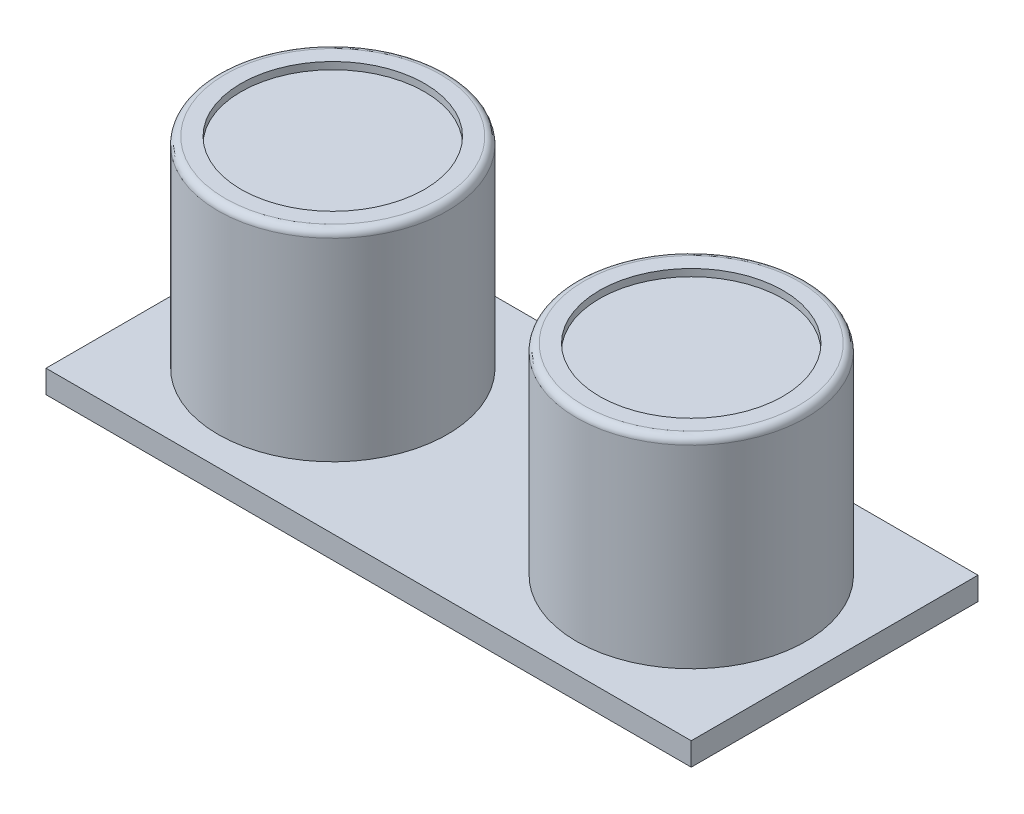
ISO-10303-21;
HEADER;
FILE_DESCRIPTION(('STEP AP214'),'2;1');
FILE_NAME('part.step','',(''),(''),'','','');
FILE_SCHEMA(('AUTOMOTIVE_DESIGN { 1 0 10303 214 1 1 1 1 }'));
ENDSEC;
DATA;
#1=APPLICATION_CONTEXT('core data for automotive mechanical design processes');
#2=APPLICATION_PROTOCOL_DEFINITION('international standard','automotive_design',2000,#1);
#3=PRODUCT_CONTEXT('',#1,'mechanical');
#4=PRODUCT('Part','Part','',(#3));
#5=PRODUCT_RELATED_PRODUCT_CATEGORY('part','',(#4));
#6=PRODUCT_DEFINITION_FORMATION('','',#4);
#7=PRODUCT_DEFINITION_CONTEXT('part definition',#1,'design');
#8=PRODUCT_DEFINITION('design','',#6,#7);
#9=PRODUCT_DEFINITION_SHAPE('','',#8);
#10=(LENGTH_UNIT() NAMED_UNIT(*) SI_UNIT(.MILLI.,.METRE.));
#11=(NAMED_UNIT(*) PLANE_ANGLE_UNIT() SI_UNIT($,.RADIAN.));
#12=(NAMED_UNIT(*) SI_UNIT($,.STERADIAN.) SOLID_ANGLE_UNIT());
#13=UNCERTAINTY_MEASURE_WITH_UNIT(LENGTH_MEASURE(1.E-05),#10,'distance_accuracy_value','');
#14=(GEOMETRIC_REPRESENTATION_CONTEXT(3) GLOBAL_UNCERTAINTY_ASSIGNED_CONTEXT((#13)) GLOBAL_UNIT_ASSIGNED_CONTEXT((#10,
#11,#12)) REPRESENTATION_CONTEXT('',''));
#15=CARTESIAN_POINT('',(0.,0.,0.));
#16=DIRECTION('',(0.,0.,1.));
#17=DIRECTION('',(1.,0.,0.));
#18=AXIS2_PLACEMENT_3D('',#15,#16,#17);
#19=CARTESIAN_POINT('',(0.,1.6,0.));
#20=DIRECTION('',(1.,0.,0.));
#21=DIRECTION('',(0.,0.,-1.));
#22=AXIS2_PLACEMENT_3D('',#19,#20,#21);
#23=PLANE('',#22);
#24=DIRECTION('',(0.,0.,1.));
#25=VECTOR('',#24,1.);
#26=CARTESIAN_POINT('',(0.,0.,0.));
#27=LINE('',#26,#25);
#28=CARTESIAN_POINT('',(0.,0.,-20.));
#29=VERTEX_POINT('',#28);
#30=CARTESIAN_POINT('',(0.,0.,0.));
#31=VERTEX_POINT('',#30);
#32=EDGE_CURVE('E104',#29,#31,#27,.T.);
#33=ORIENTED_EDGE('',*,*,#32,.T.);
#34=DIRECTION('',(0.,-1.,0.));
#35=VECTOR('',#34,1.);
#36=CARTESIAN_POINT('',(0.,1.6,0.));
#37=LINE('',#36,#35);
#38=CARTESIAN_POINT('',(0.,1.6,0.));
#39=VERTEX_POINT('',#38);
#40=EDGE_CURVE('E95',#39,#31,#37,.T.);
#41=ORIENTED_EDGE('',*,*,#40,.F.);
#42=DIRECTION('',(0.,0.,1.));
#43=VECTOR('',#42,1.);
#44=CARTESIAN_POINT('',(0.,1.6,0.));
#45=LINE('',#44,#43);
#46=CARTESIAN_POINT('',(0.,1.6,-20.));
#47=VERTEX_POINT('',#46);
#48=EDGE_CURVE('E89',#47,#39,#45,.T.);
#49=ORIENTED_EDGE('',*,*,#48,.F.);
#50=DIRECTION('',(0.,-1.,0.));
#51=VECTOR('',#50,1.);
#52=CARTESIAN_POINT('',(0.,1.6,-20.));
#53=LINE('',#52,#51);
#54=EDGE_CURVE('E100',#47,#29,#53,.T.);
#55=ORIENTED_EDGE('',*,*,#54,.T.);
#56=EDGE_LOOP('',(#33,#41,#49,#55));
#57=FACE_BOUND('',#56,.T.);
#58=ADVANCED_FACE('F36',(#57),#23,.F.);
#59=CARTESIAN_POINT('',(0.,1.6,0.));
#60=DIRECTION('',(0.,0.,-1.));
#61=DIRECTION('',(-1.,0.,0.));
#62=AXIS2_PLACEMENT_3D('',#59,#60,#61);
#63=PLANE('',#62);
#64=DIRECTION('',(1.,0.,0.));
#65=VECTOR('',#64,1.);
#66=CARTESIAN_POINT('',(0.,0.,0.));
#67=LINE('',#66,#65);
#68=CARTESIAN_POINT('',(45.,0.,0.));
#69=VERTEX_POINT('',#68);
#70=EDGE_CURVE('E94',#31,#69,#67,.T.);
#71=ORIENTED_EDGE('',*,*,#70,.T.);
#72=DIRECTION('',(0.,-1.,0.));
#73=VECTOR('',#72,1.);
#74=CARTESIAN_POINT('',(45.,1.6,0.));
#75=LINE('',#74,#73);
#76=CARTESIAN_POINT('',(45.,1.6,0.));
#77=VERTEX_POINT('',#76);
#78=EDGE_CURVE('E92',#77,#69,#75,.T.);
#79=ORIENTED_EDGE('',*,*,#78,.F.);
#80=DIRECTION('',(1.,0.,0.));
#81=VECTOR('',#80,1.);
#82=CARTESIAN_POINT('',(0.,1.6,0.));
#83=LINE('',#82,#81);
#84=EDGE_CURVE('E84',#39,#77,#83,.T.);
#85=ORIENTED_EDGE('',*,*,#84,.F.);
#86=ORIENTED_EDGE('',*,*,#40,.T.);
#87=EDGE_LOOP('',(#71,#79,#85,#86));
#88=FACE_BOUND('',#87,.T.);
#89=ADVANCED_FACE('F93',(#88),#63,.F.);
#90=CARTESIAN_POINT('',(45.,1.6,0.));
#91=DIRECTION('',(-1.,0.,0.));
#92=DIRECTION('',(0.,0.,1.));
#93=AXIS2_PLACEMENT_3D('',#90,#91,#92);
#94=PLANE('',#93);
#95=DIRECTION('',(0.,0.,-1.));
#96=VECTOR('',#95,1.);
#97=CARTESIAN_POINT('',(45.,0.,0.));
#98=LINE('',#97,#96);
#99=CARTESIAN_POINT('',(45.,0.,-20.));
#100=VERTEX_POINT('',#99);
#101=EDGE_CURVE('E70',#69,#100,#98,.T.);
#102=ORIENTED_EDGE('',*,*,#101,.T.);
#103=DIRECTION('',(0.,-1.,0.));
#104=VECTOR('',#103,1.);
#105=CARTESIAN_POINT('',(45.,1.6,-20.));
#106=LINE('',#105,#104);
#107=CARTESIAN_POINT('',(45.,1.6,-20.));
#108=VERTEX_POINT('',#107);
#109=EDGE_CURVE('E96',#108,#100,#106,.T.);
#110=ORIENTED_EDGE('',*,*,#109,.F.);
#111=DIRECTION('',(0.,0.,-1.));
#112=VECTOR('',#111,1.);
#113=CARTESIAN_POINT('',(45.,1.6,0.));
#114=LINE('',#113,#112);
#115=EDGE_CURVE('E87',#77,#108,#114,.T.);
#116=ORIENTED_EDGE('',*,*,#115,.F.);
#117=ORIENTED_EDGE('',*,*,#78,.T.);
#118=EDGE_LOOP('',(#102,#110,#116,#117));
#119=FACE_BOUND('',#118,.T.);
#120=ADVANCED_FACE('F98',(#119),#94,.F.);
#121=CARTESIAN_POINT('',(0.,1.6,-20.));
#122=DIRECTION('',(0.,0.,1.));
#123=DIRECTION('',(1.,0.,0.));
#124=AXIS2_PLACEMENT_3D('',#121,#122,#123);
#125=PLANE('',#124);
#126=DIRECTION('',(-1.,0.,0.));
#127=VECTOR('',#126,1.);
#128=CARTESIAN_POINT('',(0.,0.,-20.));
#129=LINE('',#128,#127);
#130=EDGE_CURVE('E76',#100,#29,#129,.T.);
#131=ORIENTED_EDGE('',*,*,#130,.T.);
#132=ORIENTED_EDGE('',*,*,#54,.F.);
#133=DIRECTION('',(-1.,0.,0.));
#134=VECTOR('',#133,1.);
#135=CARTESIAN_POINT('',(0.,1.6,-20.));
#136=LINE('',#135,#134);
#137=EDGE_CURVE('E53',#108,#47,#136,.T.);
#138=ORIENTED_EDGE('',*,*,#137,.F.);
#139=ORIENTED_EDGE('',*,*,#109,.T.);
#140=EDGE_LOOP('',(#131,#132,#138,#139));
#141=FACE_BOUND('',#140,.T.);
#142=ADVANCED_FACE('F150',(#141),#125,.F.);
#143=CARTESIAN_POINT('',(0.,1.6,0.));
#144=DIRECTION('',(0.,-1.,0.));
#145=DIRECTION('',(0.,0.,-1.));
#146=AXIS2_PLACEMENT_3D('',#143,#144,#145);
#147=PLANE('',#146);
#148=CARTESIAN_POINT('',(35.,1.6,-10.));
#149=DIRECTION('',(0.,-1.,0.));
#150=DIRECTION('',(0.,0.,-1.));
#151=AXIS2_PLACEMENT_3D('',#148,#149,#150);
#152=CIRCLE('',#151,8.);
#153=CARTESIAN_POINT('',(35.,1.6,-18.));
#154=VERTEX_POINT('',#153);
#155=EDGE_CURVE('E117',#154,#154,#152,.F.);
#156=ORIENTED_EDGE('',*,*,#155,.F.);
#157=EDGE_LOOP('',(#156));
#158=FACE_BOUND('',#157,.T.);
#159=CARTESIAN_POINT('',(10.,1.6,-10.));
#160=DIRECTION('',(0.,-1.,0.));
#161=DIRECTION('',(0.,0.,-1.));
#162=AXIS2_PLACEMENT_3D('',#159,#160,#161);
#163=CIRCLE('',#162,8.);
#164=CARTESIAN_POINT('',(10.,1.6,-18.));
#165=VERTEX_POINT('',#164);
#166=EDGE_CURVE('E114',#165,#165,#163,.F.);
#167=ORIENTED_EDGE('',*,*,#166,.F.);
#168=EDGE_LOOP('',(#167));
#169=FACE_BOUND('',#168,.T.);
#170=ORIENTED_EDGE('',*,*,#48,.T.);
#171=ORIENTED_EDGE('',*,*,#84,.T.);
#172=ORIENTED_EDGE('',*,*,#115,.T.);
#173=ORIENTED_EDGE('',*,*,#137,.T.);
#174=EDGE_LOOP('',(#170,#171,#172,#173));
#175=FACE_BOUND('',#174,.T.);
#176=ADVANCED_FACE('F85',(#158,#169,#175),#147,.F.);
#177=CARTESIAN_POINT('',(0.,0.,0.));
#178=DIRECTION('',(0.,-1.,0.));
#179=DIRECTION('',(0.,0.,-1.));
#180=AXIS2_PLACEMENT_3D('',#177,#178,#179);
#181=PLANE('',#180);
#182=ORIENTED_EDGE('',*,*,#32,.F.);
#183=ORIENTED_EDGE('',*,*,#130,.F.);
#184=ORIENTED_EDGE('',*,*,#101,.F.);
#185=ORIENTED_EDGE('',*,*,#70,.F.);
#186=EDGE_LOOP('',(#182,#183,#184,#185));
#187=FACE_BOUND('',#186,.T.);
#188=ADVANCED_FACE('F153',(#187),#181,.T.);
#189=CARTESIAN_POINT('',(10.,15.6,-10.));
#190=DIRECTION('',(0.,-1.,0.));
#191=DIRECTION('',(0.,0.,-1.));
#192=AXIS2_PLACEMENT_3D('',#189,#190,#191);
#193=CYLINDRICAL_SURFACE('',#192,8.);
#194=CARTESIAN_POINT('',(10.,15.1,-10.));
#195=DIRECTION('',(0.,1.,0.));
#196=DIRECTION('',(0.,0.,1.));
#197=AXIS2_PLACEMENT_3D('',#194,#195,#196);
#198=CIRCLE('',#197,8.);
#199=CARTESIAN_POINT('',(10.,15.1,-2.));
#200=VERTEX_POINT('',#199);
#201=EDGE_CURVE('E11',#200,#200,#198,.F.);
#202=ORIENTED_EDGE('',*,*,#201,.T.);
#203=EDGE_LOOP('',(#202));
#204=FACE_BOUND('',#203,.T.);
#205=ORIENTED_EDGE('',*,*,#166,.T.);
#206=EDGE_LOOP('',(#205));
#207=FACE_BOUND('',#206,.T.);
#208=ADVANCED_FACE('F156',(#204,#207),#193,.T.);
#209=CARTESIAN_POINT('',(10.,15.6,-10.));
#210=DIRECTION('',(0.,1.,0.));
#211=DIRECTION('',(0.,0.,1.));
#212=AXIS2_PLACEMENT_3D('',#209,#210,#211);
#213=PLANE('',#212);
#214=CARTESIAN_POINT('',(10.,15.6,-10.));
#215=DIRECTION('',(0.,1.,0.));
#216=DIRECTION('',(0.,0.,1.));
#217=AXIS2_PLACEMENT_3D('',#214,#215,#216);
#218=CIRCLE('',#217,7.5);
#219=CARTESIAN_POINT('',(10.,15.6,-2.5));
#220=VERTEX_POINT('',#219);
#221=EDGE_CURVE('E45',#220,#220,#218,.T.);
#222=ORIENTED_EDGE('',*,*,#221,.T.);
#223=EDGE_LOOP('',(#222));
#224=FACE_BOUND('',#223,.T.);
#225=CARTESIAN_POINT('',(10.,15.6,-10.));
#226=DIRECTION('',(0.,1.,0.));
#227=DIRECTION('',(0.,0.,1.));
#228=AXIS2_PLACEMENT_3D('',#225,#226,#227);
#229=CIRCLE('',#228,6.4);
#230=CARTESIAN_POINT('',(10.,15.6,-3.6));
#231=VERTEX_POINT('',#230);
#232=EDGE_CURVE('E192',#231,#231,#229,.T.);
#233=ORIENTED_EDGE('',*,*,#232,.F.);
#234=EDGE_LOOP('',(#233));
#235=FACE_BOUND('',#234,.T.);
#236=ADVANCED_FACE('F128',(#224,#235),#213,.T.);
#237=CARTESIAN_POINT('',(35.,15.6,-10.));
#238=DIRECTION('',(0.,-1.,0.));
#239=DIRECTION('',(0.,0.,-1.));
#240=AXIS2_PLACEMENT_3D('',#237,#238,#239);
#241=CYLINDRICAL_SURFACE('',#240,8.);
#242=CARTESIAN_POINT('',(35.,15.1,-10.));
#243=DIRECTION('',(0.,1.,0.));
#244=DIRECTION('',(0.,0.,1.));
#245=AXIS2_PLACEMENT_3D('',#242,#243,#244);
#246=CIRCLE('',#245,8.);
#247=CARTESIAN_POINT('',(35.,15.1,-2.));
#248=VERTEX_POINT('',#247);
#249=EDGE_CURVE('E123',#248,#248,#246,.F.);
#250=ORIENTED_EDGE('',*,*,#249,.T.);
#251=EDGE_LOOP('',(#250));
#252=FACE_BOUND('',#251,.T.);
#253=ORIENTED_EDGE('',*,*,#155,.T.);
#254=EDGE_LOOP('',(#253));
#255=FACE_BOUND('',#254,.T.);
#256=ADVANCED_FACE('F166',(#252,#255),#241,.T.);
#257=CARTESIAN_POINT('',(35.,15.6,-10.));
#258=DIRECTION('',(0.,1.,0.));
#259=DIRECTION('',(0.,0.,1.));
#260=AXIS2_PLACEMENT_3D('',#257,#258,#259);
#261=PLANE('',#260);
#262=CARTESIAN_POINT('',(35.,15.6,-10.));
#263=DIRECTION('',(0.,1.,0.));
#264=DIRECTION('',(0.,0.,1.));
#265=AXIS2_PLACEMENT_3D('',#262,#263,#264);
#266=CIRCLE('',#265,7.5);
#267=CARTESIAN_POINT('',(35.,15.6,-2.5));
#268=VERTEX_POINT('',#267);
#269=EDGE_CURVE('E120',#268,#268,#266,.T.);
#270=ORIENTED_EDGE('',*,*,#269,.T.);
#271=EDGE_LOOP('',(#270));
#272=FACE_BOUND('',#271,.T.);
#273=CARTESIAN_POINT('',(35.,15.6,-10.));
#274=DIRECTION('',(0.,1.,0.));
#275=DIRECTION('',(0.,0.,1.));
#276=AXIS2_PLACEMENT_3D('',#273,#274,#275);
#277=CIRCLE('',#276,6.39999999999999);
#278=CARTESIAN_POINT('',(35.,15.6,-3.60000000000001));
#279=VERTEX_POINT('',#278);
#280=EDGE_CURVE('E200',#279,#279,#277,.T.);
#281=ORIENTED_EDGE('',*,*,#280,.F.);
#282=EDGE_LOOP('',(#281));
#283=FACE_BOUND('',#282,.T.);
#284=ADVANCED_FACE('F169',(#272,#283),#261,.T.);
#285=CARTESIAN_POINT('',(35.,15.1,-10.));
#286=DIRECTION('',(0.,1.,0.));
#287=DIRECTION('',(0.,0.,1.));
#288=AXIS2_PLACEMENT_3D('',#285,#286,#287);
#289=CYLINDRICAL_SURFACE('',#288,6.39999999999999);
#290=CARTESIAN_POINT('',(35.,15.1,-10.));
#291=DIRECTION('',(0.,1.,0.));
#292=DIRECTION('',(0.,0.,1.));
#293=AXIS2_PLACEMENT_3D('',#290,#291,#292);
#294=CIRCLE('',#293,6.39999999999999);
#295=CARTESIAN_POINT('',(35.,15.1,-3.60000000000001));
#296=VERTEX_POINT('',#295);
#297=EDGE_CURVE('E195',#296,#296,#294,.T.);
#298=ORIENTED_EDGE('',*,*,#297,.F.);
#299=EDGE_LOOP('',(#298));
#300=FACE_BOUND('',#299,.T.);
#301=ORIENTED_EDGE('',*,*,#280,.T.);
#302=EDGE_LOOP('',(#301));
#303=FACE_BOUND('',#302,.T.);
#304=ADVANCED_FACE('F173',(#300,#303),#289,.F.);
#305=CARTESIAN_POINT('',(35.,15.1,-10.));
#306=DIRECTION('',(0.,1.,0.));
#307=DIRECTION('',(0.,0.,1.));
#308=AXIS2_PLACEMENT_3D('',#305,#306,#307);
#309=PLANE('',#308);
#310=ORIENTED_EDGE('',*,*,#297,.T.);
#311=EDGE_LOOP('',(#310));
#312=FACE_BOUND('',#311,.T.);
#313=ADVANCED_FACE('F177',(#312),#309,.T.);
#314=CARTESIAN_POINT('',(10.,15.1,-10.));
#315=DIRECTION('',(0.,1.,0.));
#316=DIRECTION('',(0.,0.,1.));
#317=AXIS2_PLACEMENT_3D('',#314,#315,#316);
#318=CYLINDRICAL_SURFACE('',#317,6.4);
#319=CARTESIAN_POINT('',(10.,15.1,-10.));
#320=DIRECTION('',(0.,1.,0.));
#321=DIRECTION('',(0.,0.,1.));
#322=AXIS2_PLACEMENT_3D('',#319,#320,#321);
#323=CIRCLE('',#322,6.4);
#324=CARTESIAN_POINT('',(10.,15.1,-3.6));
#325=VERTEX_POINT('',#324);
#326=EDGE_CURVE('E107',#325,#325,#323,.T.);
#327=ORIENTED_EDGE('',*,*,#326,.F.);
#328=EDGE_LOOP('',(#327));
#329=FACE_BOUND('',#328,.T.);
#330=ORIENTED_EDGE('',*,*,#232,.T.);
#331=EDGE_LOOP('',(#330));
#332=FACE_BOUND('',#331,.T.);
#333=ADVANCED_FACE('F181',(#329,#332),#318,.F.);
#334=CARTESIAN_POINT('',(10.,15.1,-10.));
#335=DIRECTION('',(0.,1.,0.));
#336=DIRECTION('',(0.,0.,1.));
#337=AXIS2_PLACEMENT_3D('',#334,#335,#336);
#338=PLANE('',#337);
#339=ORIENTED_EDGE('',*,*,#326,.T.);
#340=EDGE_LOOP('',(#339));
#341=FACE_BOUND('',#340,.T.);
#342=ADVANCED_FACE('F137',(#341),#338,.T.);
#343=CARTESIAN_POINT('',(35.,15.1,-10.));
#344=DIRECTION('',(0.,1.,0.));
#345=DIRECTION('',(0.,0.,1.));
#346=AXIS2_PLACEMENT_3D('',#343,#344,#345);
#347=TOROIDAL_SURFACE('',#346,7.5,0.5);
#348=ORIENTED_EDGE('',*,*,#249,.F.);
#349=EDGE_LOOP('',(#348));
#350=FACE_BOUND('',#349,.T.);
#351=ORIENTED_EDGE('',*,*,#269,.F.);
#352=EDGE_LOOP('',(#351));
#353=FACE_BOUND('',#352,.T.);
#354=ADVANCED_FACE('F132',(#350,#353),#347,.T.);
#355=CARTESIAN_POINT('',(10.,15.1,-10.));
#356=DIRECTION('',(0.,1.,0.));
#357=DIRECTION('',(0.,0.,1.));
#358=AXIS2_PLACEMENT_3D('',#355,#356,#357);
#359=TOROIDAL_SURFACE('',#358,7.5,0.5);
#360=ORIENTED_EDGE('',*,*,#201,.F.);
#361=EDGE_LOOP('',(#360));
#362=FACE_BOUND('',#361,.T.);
#363=ORIENTED_EDGE('',*,*,#221,.F.);
#364=EDGE_LOOP('',(#363));
#365=FACE_BOUND('',#364,.T.);
#366=ADVANCED_FACE('F38',(#362,#365),#359,.T.);
#367=CLOSED_SHELL('',(#58,#89,#120,#142,#176,#188,#208,#236,#256,#284,#304,#313,#333,#342,#354,#366));
#368=MANIFOLD_SOLID_BREP('B2',#367);
#369=ADVANCED_BREP_SHAPE_REPRESENTATION('',(#18,#368),#14);
#370=SHAPE_DEFINITION_REPRESENTATION(#9,#369);
ENDSEC;
END-ISO-10303-21;
